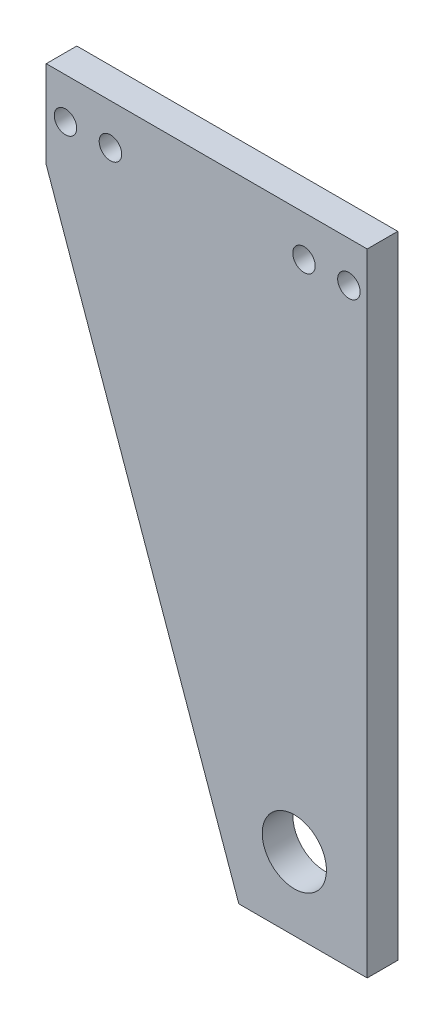
ISO-10303-21;
HEADER;
FILE_DESCRIPTION(('STEP AP214'),'2;1');
FILE_NAME('part.step','',(''),(''),'','','');
FILE_SCHEMA(('AUTOMOTIVE_DESIGN { 1 0 10303 214 1 1 1 1 }'));
ENDSEC;
DATA;
#1=APPLICATION_CONTEXT('core data for automotive mechanical design processes');
#2=APPLICATION_PROTOCOL_DEFINITION('international standard','automotive_design',2000,#1);
#3=PRODUCT_CONTEXT('',#1,'mechanical');
#4=PRODUCT('Part','Part','',(#3));
#5=PRODUCT_RELATED_PRODUCT_CATEGORY('part','',(#4));
#6=PRODUCT_DEFINITION_FORMATION('','',#4);
#7=PRODUCT_DEFINITION_CONTEXT('part definition',#1,'design');
#8=PRODUCT_DEFINITION('design','',#6,#7);
#9=PRODUCT_DEFINITION_SHAPE('','',#8);
#10=(LENGTH_UNIT() NAMED_UNIT(*) SI_UNIT(.MILLI.,.METRE.));
#11=(NAMED_UNIT(*) PLANE_ANGLE_UNIT() SI_UNIT($,.RADIAN.));
#12=(NAMED_UNIT(*) SI_UNIT($,.STERADIAN.) SOLID_ANGLE_UNIT());
#13=UNCERTAINTY_MEASURE_WITH_UNIT(LENGTH_MEASURE(1.E-05),#10,'distance_accuracy_value','');
#14=(GEOMETRIC_REPRESENTATION_CONTEXT(3) GLOBAL_UNCERTAINTY_ASSIGNED_CONTEXT((#13)) GLOBAL_UNIT_ASSIGNED_CONTEXT((#10,
#11,#12)) REPRESENTATION_CONTEXT('',''));
#15=CARTESIAN_POINT('',(0.,0.,0.));
#16=DIRECTION('',(0.,0.,1.));
#17=DIRECTION('',(1.,0.,0.));
#18=AXIS2_PLACEMENT_3D('',#15,#16,#17);
#19=CARTESIAN_POINT('',(0.,0.,4.7625));
#20=DIRECTION('',(0.,0.,-1.));
#21=DIRECTION('',(-1.,0.,0.));
#22=AXIS2_PLACEMENT_3D('',#19,#20,#21);
#23=PLANE('',#22);
#24=DIRECTION('',(-1.,0.,0.));
#25=VECTOR('',#24,1.);
#26=CARTESIAN_POINT('',(-50.,0.,4.7625));
#27=LINE('',#26,#25);
#28=CARTESIAN_POINT('',(0.,0.,4.7625));
#29=VERTEX_POINT('',#28);
#30=CARTESIAN_POINT('',(-50.,0.,4.7625));
#31=VERTEX_POINT('',#30);
#32=EDGE_CURVE('E133',#29,#31,#27,.T.);
#33=ORIENTED_EDGE('',*,*,#32,.T.);
#34=DIRECTION('',(0.,-1.,0.));
#35=VECTOR('',#34,1.);
#36=CARTESIAN_POINT('',(-50.,0.,4.7625));
#37=LINE('',#36,#35);
#38=CARTESIAN_POINT('',(-50.,-13.6326134319742,4.7625));
#39=VERTEX_POINT('',#38);
#40=EDGE_CURVE('E91',#31,#39,#37,.T.);
#41=ORIENTED_EDGE('',*,*,#40,.T.);
#42=DIRECTION('',(0.333806859233765,-0.942641491092181,0.));
#43=VECTOR('',#42,1.);
#44=CARTESIAN_POINT('',(-20.,-98.35,4.7625));
#45=LINE('',#44,#43);
#46=CARTESIAN_POINT('',(-20.,-98.35,4.7625));
#47=VERTEX_POINT('',#46);
#48=EDGE_CURVE('E95',#39,#47,#45,.T.);
#49=ORIENTED_EDGE('',*,*,#48,.T.);
#50=DIRECTION('',(1.,0.,0.));
#51=VECTOR('',#50,1.);
#52=CARTESIAN_POINT('',(0.,-98.35,4.7625));
#53=LINE('',#52,#51);
#54=CARTESIAN_POINT('',(0.,-98.35,4.7625));
#55=VERTEX_POINT('',#54);
#56=EDGE_CURVE('E99',#47,#55,#53,.T.);
#57=ORIENTED_EDGE('',*,*,#56,.T.);
#58=DIRECTION('',(0.,1.,0.));
#59=VECTOR('',#58,1.);
#60=CARTESIAN_POINT('',(0.,0.,4.7625));
#61=LINE('',#60,#59);
#62=EDGE_CURVE('E57',#55,#29,#61,.T.);
#63=ORIENTED_EDGE('',*,*,#62,.T.);
#64=EDGE_LOOP('',(#33,#41,#49,#57,#63));
#65=FACE_BOUND('',#64,.T.);
#66=CARTESIAN_POINT('',(-2.85,-6.35,4.7625));
#67=DIRECTION('',(0.,0.,1.));
#68=DIRECTION('',(1.,0.,0.));
#69=AXIS2_PLACEMENT_3D('',#66,#67,#68);
#70=CIRCLE('',#69,1.75);
#71=CARTESIAN_POINT('',(-1.1,-6.35,4.7625));
#72=VERTEX_POINT('',#71);
#73=EDGE_CURVE('E124',#72,#72,#70,.T.);
#74=ORIENTED_EDGE('',*,*,#73,.F.);
#75=EDGE_LOOP('',(#74));
#76=FACE_BOUND('',#75,.T.);
#77=CARTESIAN_POINT('',(-9.85,-6.35,4.7625));
#78=DIRECTION('',(0.,0.,1.));
#79=DIRECTION('',(1.,0.,0.));
#80=AXIS2_PLACEMENT_3D('',#77,#78,#79);
#81=CIRCLE('',#80,1.75);
#82=CARTESIAN_POINT('',(-8.1,-6.35,4.7625));
#83=VERTEX_POINT('',#82);
#84=EDGE_CURVE('E211',#83,#83,#81,.T.);
#85=ORIENTED_EDGE('',*,*,#84,.F.);
#86=EDGE_LOOP('',(#85));
#87=FACE_BOUND('',#86,.T.);
#88=CARTESIAN_POINT('',(-40.,-6.35,4.7625));
#89=DIRECTION('',(0.,0.,1.));
#90=DIRECTION('',(1.,0.,0.));
#91=AXIS2_PLACEMENT_3D('',#88,#89,#90);
#92=CIRCLE('',#91,1.75);
#93=CARTESIAN_POINT('',(-38.25,-6.35,4.7625));
#94=VERTEX_POINT('',#93);
#95=EDGE_CURVE('E203',#94,#94,#92,.T.);
#96=ORIENTED_EDGE('',*,*,#95,.F.);
#97=EDGE_LOOP('',(#96));
#98=FACE_BOUND('',#97,.T.);
#99=CARTESIAN_POINT('',(-47.,-6.35000000000001,4.7625));
#100=DIRECTION('',(0.,0.,1.));
#101=DIRECTION('',(1.,0.,0.));
#102=AXIS2_PLACEMENT_3D('',#99,#100,#101);
#103=CIRCLE('',#102,1.75);
#104=CARTESIAN_POINT('',(-45.25,-6.35000000000001,4.7625));
#105=VERTEX_POINT('',#104);
#106=EDGE_CURVE('E195',#105,#105,#103,.T.);
#107=ORIENTED_EDGE('',*,*,#106,.F.);
#108=EDGE_LOOP('',(#107));
#109=FACE_BOUND('',#108,.T.);
#110=CARTESIAN_POINT('',(-11.35,-87.,4.7625));
#111=DIRECTION('',(0.,0.,1.));
#112=DIRECTION('',(1.,0.,0.));
#113=AXIS2_PLACEMENT_3D('',#110,#111,#112);
#114=CIRCLE('',#113,5.00000000000001);
#115=CARTESIAN_POINT('',(-6.34999999999999,-87.,4.7625));
#116=VERTEX_POINT('',#115);
#117=EDGE_CURVE('E184',#116,#116,#114,.T.);
#118=ORIENTED_EDGE('',*,*,#117,.F.);
#119=EDGE_LOOP('',(#118));
#120=FACE_BOUND('',#119,.T.);
#121=ADVANCED_FACE('F39',(#65,#76,#87,#98,#109,#120),#23,.F.);
#122=CARTESIAN_POINT('',(0.,0.,0.));
#123=DIRECTION('',(0.,0.,-1.));
#124=DIRECTION('',(-1.,0.,0.));
#125=AXIS2_PLACEMENT_3D('',#122,#123,#124);
#126=PLANE('',#125);
#127=CARTESIAN_POINT('',(-47.,-6.35000000000001,0.));
#128=DIRECTION('',(0.,0.,1.));
#129=DIRECTION('',(1.,0.,0.));
#130=AXIS2_PLACEMENT_3D('',#127,#128,#129);
#131=CIRCLE('',#130,1.75);
#132=CARTESIAN_POINT('',(-45.25,-6.35000000000001,0.));
#133=VERTEX_POINT('',#132);
#134=EDGE_CURVE('E192',#133,#133,#131,.T.);
#135=ORIENTED_EDGE('',*,*,#134,.T.);
#136=EDGE_LOOP('',(#135));
#137=FACE_BOUND('',#136,.T.);
#138=CARTESIAN_POINT('',(-9.85,-6.35,0.));
#139=DIRECTION('',(0.,0.,1.));
#140=DIRECTION('',(1.,0.,0.));
#141=AXIS2_PLACEMENT_3D('',#138,#139,#140);
#142=CIRCLE('',#141,1.75);
#143=CARTESIAN_POINT('',(-8.1,-6.35,0.));
#144=VERTEX_POINT('',#143);
#145=EDGE_CURVE('E207',#144,#144,#142,.T.);
#146=ORIENTED_EDGE('',*,*,#145,.T.);
#147=EDGE_LOOP('',(#146));
#148=FACE_BOUND('',#147,.T.);
#149=DIRECTION('',(-1.,0.,0.));
#150=VECTOR('',#149,1.);
#151=CARTESIAN_POINT('',(-50.,0.,0.));
#152=LINE('',#151,#150);
#153=CARTESIAN_POINT('',(0.,0.,0.));
#154=VERTEX_POINT('',#153);
#155=CARTESIAN_POINT('',(-50.,0.,0.));
#156=VERTEX_POINT('',#155);
#157=EDGE_CURVE('E119',#154,#156,#152,.T.);
#158=ORIENTED_EDGE('',*,*,#157,.F.);
#159=DIRECTION('',(0.,1.,0.));
#160=VECTOR('',#159,1.);
#161=CARTESIAN_POINT('',(0.,0.,0.));
#162=LINE('',#161,#160);
#163=CARTESIAN_POINT('',(0.,-98.35,0.));
#164=VERTEX_POINT('',#163);
#165=EDGE_CURVE('E83',#164,#154,#162,.T.);
#166=ORIENTED_EDGE('',*,*,#165,.F.);
#167=DIRECTION('',(1.,0.,0.));
#168=VECTOR('',#167,1.);
#169=CARTESIAN_POINT('',(0.,-98.35,0.));
#170=LINE('',#169,#168);
#171=CARTESIAN_POINT('',(-20.,-98.35,0.));
#172=VERTEX_POINT('',#171);
#173=EDGE_CURVE('E77',#172,#164,#170,.T.);
#174=ORIENTED_EDGE('',*,*,#173,.F.);
#175=DIRECTION('',(0.333806859233765,-0.942641491092181,0.));
#176=VECTOR('',#175,1.);
#177=CARTESIAN_POINT('',(-20.,-98.35,0.));
#178=LINE('',#177,#176);
#179=CARTESIAN_POINT('',(-50.,-13.6326134319742,0.));
#180=VERTEX_POINT('',#179);
#181=EDGE_CURVE('E107',#180,#172,#178,.T.);
#182=ORIENTED_EDGE('',*,*,#181,.F.);
#183=DIRECTION('',(0.,-1.,0.));
#184=VECTOR('',#183,1.);
#185=CARTESIAN_POINT('',(-50.,0.,0.));
#186=LINE('',#185,#184);
#187=EDGE_CURVE('E123',#156,#180,#186,.T.);
#188=ORIENTED_EDGE('',*,*,#187,.F.);
#189=EDGE_LOOP('',(#158,#166,#174,#182,#188));
#190=FACE_BOUND('',#189,.T.);
#191=CARTESIAN_POINT('',(-2.85,-6.35,0.));
#192=DIRECTION('',(0.,0.,1.));
#193=DIRECTION('',(1.,0.,0.));
#194=AXIS2_PLACEMENT_3D('',#191,#192,#193);
#195=CIRCLE('',#194,1.75);
#196=CARTESIAN_POINT('',(-1.1,-6.35,0.));
#197=VERTEX_POINT('',#196);
#198=EDGE_CURVE('E215',#197,#197,#195,.T.);
#199=ORIENTED_EDGE('',*,*,#198,.T.);
#200=EDGE_LOOP('',(#199));
#201=FACE_BOUND('',#200,.T.);
#202=CARTESIAN_POINT('',(-40.,-6.35,0.));
#203=DIRECTION('',(0.,0.,1.));
#204=DIRECTION('',(1.,0.,0.));
#205=AXIS2_PLACEMENT_3D('',#202,#203,#204);
#206=CIRCLE('',#205,1.75);
#207=CARTESIAN_POINT('',(-38.25,-6.35,0.));
#208=VERTEX_POINT('',#207);
#209=EDGE_CURVE('E199',#208,#208,#206,.T.);
#210=ORIENTED_EDGE('',*,*,#209,.T.);
#211=EDGE_LOOP('',(#210));
#212=FACE_BOUND('',#211,.T.);
#213=CARTESIAN_POINT('',(-11.35,-87.,0.));
#214=DIRECTION('',(0.,0.,1.));
#215=DIRECTION('',(1.,0.,0.));
#216=AXIS2_PLACEMENT_3D('',#213,#214,#215);
#217=CIRCLE('',#216,5.00000000000001);
#218=CARTESIAN_POINT('',(-6.34999999999999,-87.,0.));
#219=VERTEX_POINT('',#218);
#220=EDGE_CURVE('E187',#219,#219,#217,.T.);
#221=ORIENTED_EDGE('',*,*,#220,.T.);
#222=EDGE_LOOP('',(#221));
#223=FACE_BOUND('',#222,.T.);
#224=ADVANCED_FACE('F140',(#137,#148,#190,#201,#212,#223),#126,.T.);
#225=CARTESIAN_POINT('',(-50.,0.,4.7625));
#226=DIRECTION('',(0.,-1.,0.));
#227=DIRECTION('',(0.,0.,-1.));
#228=AXIS2_PLACEMENT_3D('',#225,#226,#227);
#229=PLANE('',#228);
#230=ORIENTED_EDGE('',*,*,#157,.T.);
#231=DIRECTION('',(0.,0.,-1.));
#232=VECTOR('',#231,1.);
#233=CARTESIAN_POINT('',(-50.,0.,4.7625));
#234=LINE('',#233,#232);
#235=EDGE_CURVE('E11',#31,#156,#234,.T.);
#236=ORIENTED_EDGE('',*,*,#235,.F.);
#237=ORIENTED_EDGE('',*,*,#32,.F.);
#238=DIRECTION('',(0.,0.,-1.));
#239=VECTOR('',#238,1.);
#240=CARTESIAN_POINT('',(0.,0.,4.7625));
#241=LINE('',#240,#239);
#242=EDGE_CURVE('E115',#29,#154,#241,.T.);
#243=ORIENTED_EDGE('',*,*,#242,.T.);
#244=EDGE_LOOP('',(#230,#236,#237,#243));
#245=FACE_BOUND('',#244,.T.);
#246=ADVANCED_FACE('F41',(#245),#229,.F.);
#247=CARTESIAN_POINT('',(-50.,0.,4.7625));
#248=DIRECTION('',(1.,0.,0.));
#249=DIRECTION('',(0.,0.,-1.));
#250=AXIS2_PLACEMENT_3D('',#247,#248,#249);
#251=PLANE('',#250);
#252=ORIENTED_EDGE('',*,*,#187,.T.);
#253=DIRECTION('',(0.,0.,-1.));
#254=VECTOR('',#253,1.);
#255=CARTESIAN_POINT('',(-50.,-13.6326134319742,4.7625));
#256=LINE('',#255,#254);
#257=EDGE_CURVE('E49',#39,#180,#256,.T.);
#258=ORIENTED_EDGE('',*,*,#257,.F.);
#259=ORIENTED_EDGE('',*,*,#40,.F.);
#260=ORIENTED_EDGE('',*,*,#235,.T.);
#261=EDGE_LOOP('',(#252,#258,#259,#260));
#262=FACE_BOUND('',#261,.T.);
#263=ADVANCED_FACE('F280',(#262),#251,.F.);
#264=CARTESIAN_POINT('',(-20.,-98.35,4.7625));
#265=DIRECTION('',(0.942641491092181,0.333806859233765,0.));
#266=DIRECTION('',(-0.333806859233765,0.942641491092181,0.));
#267=AXIS2_PLACEMENT_3D('',#264,#265,#266);
#268=PLANE('',#267);
#269=ORIENTED_EDGE('',*,*,#181,.T.);
#270=DIRECTION('',(0.,0.,-1.));
#271=VECTOR('',#270,1.);
#272=CARTESIAN_POINT('',(-20.,-98.35,4.7625));
#273=LINE('',#272,#271);
#274=EDGE_CURVE('E104',#47,#172,#273,.T.);
#275=ORIENTED_EDGE('',*,*,#274,.F.);
#276=ORIENTED_EDGE('',*,*,#48,.F.);
#277=ORIENTED_EDGE('',*,*,#257,.T.);
#278=EDGE_LOOP('',(#269,#275,#276,#277));
#279=FACE_BOUND('',#278,.T.);
#280=ADVANCED_FACE('F105',(#279),#268,.F.);
#281=CARTESIAN_POINT('',(0.,-98.35,4.7625));
#282=DIRECTION('',(0.,1.,0.));
#283=DIRECTION('',(0.,0.,1.));
#284=AXIS2_PLACEMENT_3D('',#281,#282,#283);
#285=PLANE('',#284);
#286=ORIENTED_EDGE('',*,*,#173,.T.);
#287=DIRECTION('',(0.,0.,-1.));
#288=VECTOR('',#287,1.);
#289=CARTESIAN_POINT('',(0.,-98.35,4.7625));
#290=LINE('',#289,#288);
#291=EDGE_CURVE('E109',#55,#164,#290,.T.);
#292=ORIENTED_EDGE('',*,*,#291,.F.);
#293=ORIENTED_EDGE('',*,*,#56,.F.);
#294=ORIENTED_EDGE('',*,*,#274,.T.);
#295=EDGE_LOOP('',(#286,#292,#293,#294));
#296=FACE_BOUND('',#295,.T.);
#297=ADVANCED_FACE('F111',(#296),#285,.F.);
#298=CARTESIAN_POINT('',(0.,0.,4.7625));
#299=DIRECTION('',(-1.,0.,0.));
#300=DIRECTION('',(0.,-1.,0.));
#301=AXIS2_PLACEMENT_3D('',#298,#299,#300);
#302=PLANE('',#301);
#303=ORIENTED_EDGE('',*,*,#165,.T.);
#304=ORIENTED_EDGE('',*,*,#242,.F.);
#305=ORIENTED_EDGE('',*,*,#62,.F.);
#306=ORIENTED_EDGE('',*,*,#291,.T.);
#307=EDGE_LOOP('',(#303,#304,#305,#306));
#308=FACE_BOUND('',#307,.T.);
#309=ADVANCED_FACE('F145',(#308),#302,.F.);
#310=CARTESIAN_POINT('',(-2.85,-6.35,4.7625));
#311=DIRECTION('',(0.,0.,-1.));
#312=DIRECTION('',(-1.,0.,0.));
#313=AXIS2_PLACEMENT_3D('',#310,#311,#312);
#314=CYLINDRICAL_SURFACE('',#313,1.75);
#315=ORIENTED_EDGE('',*,*,#73,.T.);
#316=EDGE_LOOP('',(#315));
#317=FACE_BOUND('',#316,.T.);
#318=ORIENTED_EDGE('',*,*,#198,.F.);
#319=EDGE_LOOP('',(#318));
#320=FACE_BOUND('',#319,.T.);
#321=ADVANCED_FACE('F147',(#317,#320),#314,.F.);
#322=CARTESIAN_POINT('',(-9.85,-6.35,4.7625));
#323=DIRECTION('',(0.,0.,-1.));
#324=DIRECTION('',(-1.,0.,0.));
#325=AXIS2_PLACEMENT_3D('',#322,#323,#324);
#326=CYLINDRICAL_SURFACE('',#325,1.75);
#327=ORIENTED_EDGE('',*,*,#84,.T.);
#328=EDGE_LOOP('',(#327));
#329=FACE_BOUND('',#328,.T.);
#330=ORIENTED_EDGE('',*,*,#145,.F.);
#331=EDGE_LOOP('',(#330));
#332=FACE_BOUND('',#331,.T.);
#333=ADVANCED_FACE('F153',(#329,#332),#326,.F.);
#334=CARTESIAN_POINT('',(-40.,-6.35,4.7625));
#335=DIRECTION('',(0.,0.,-1.));
#336=DIRECTION('',(-1.,0.,0.));
#337=AXIS2_PLACEMENT_3D('',#334,#335,#336);
#338=CYLINDRICAL_SURFACE('',#337,1.75);
#339=ORIENTED_EDGE('',*,*,#95,.T.);
#340=EDGE_LOOP('',(#339));
#341=FACE_BOUND('',#340,.T.);
#342=ORIENTED_EDGE('',*,*,#209,.F.);
#343=EDGE_LOOP('',(#342));
#344=FACE_BOUND('',#343,.T.);
#345=ADVANCED_FACE('F167',(#341,#344),#338,.F.);
#346=CARTESIAN_POINT('',(-47.,-6.35000000000001,4.7625));
#347=DIRECTION('',(0.,0.,-1.));
#348=DIRECTION('',(-1.,0.,0.));
#349=AXIS2_PLACEMENT_3D('',#346,#347,#348);
#350=CYLINDRICAL_SURFACE('',#349,1.75);
#351=ORIENTED_EDGE('',*,*,#106,.T.);
#352=EDGE_LOOP('',(#351));
#353=FACE_BOUND('',#352,.T.);
#354=ORIENTED_EDGE('',*,*,#134,.F.);
#355=EDGE_LOOP('',(#354));
#356=FACE_BOUND('',#355,.T.);
#357=ADVANCED_FACE('F171',(#353,#356),#350,.F.);
#358=CARTESIAN_POINT('',(-11.35,-87.,4.7625));
#359=DIRECTION('',(0.,0.,-1.));
#360=DIRECTION('',(-1.,0.,0.));
#361=AXIS2_PLACEMENT_3D('',#358,#359,#360);
#362=CYLINDRICAL_SURFACE('',#361,5.00000000000001);
#363=ORIENTED_EDGE('',*,*,#117,.T.);
#364=EDGE_LOOP('',(#363));
#365=FACE_BOUND('',#364,.T.);
#366=ORIENTED_EDGE('',*,*,#220,.F.);
#367=EDGE_LOOP('',(#366));
#368=FACE_BOUND('',#367,.T.);
#369=ADVANCED_FACE('F175',(#365,#368),#362,.F.);
#370=CLOSED_SHELL('',(#121,#224,#246,#263,#280,#297,#309,#321,#333,#345,#357,#369));
#371=MANIFOLD_SOLID_BREP('B2',#370);
#372=ADVANCED_BREP_SHAPE_REPRESENTATION('',(#18,#371),#14);
#373=SHAPE_DEFINITION_REPRESENTATION(#9,#372);
ENDSEC;
END-ISO-10303-21;
